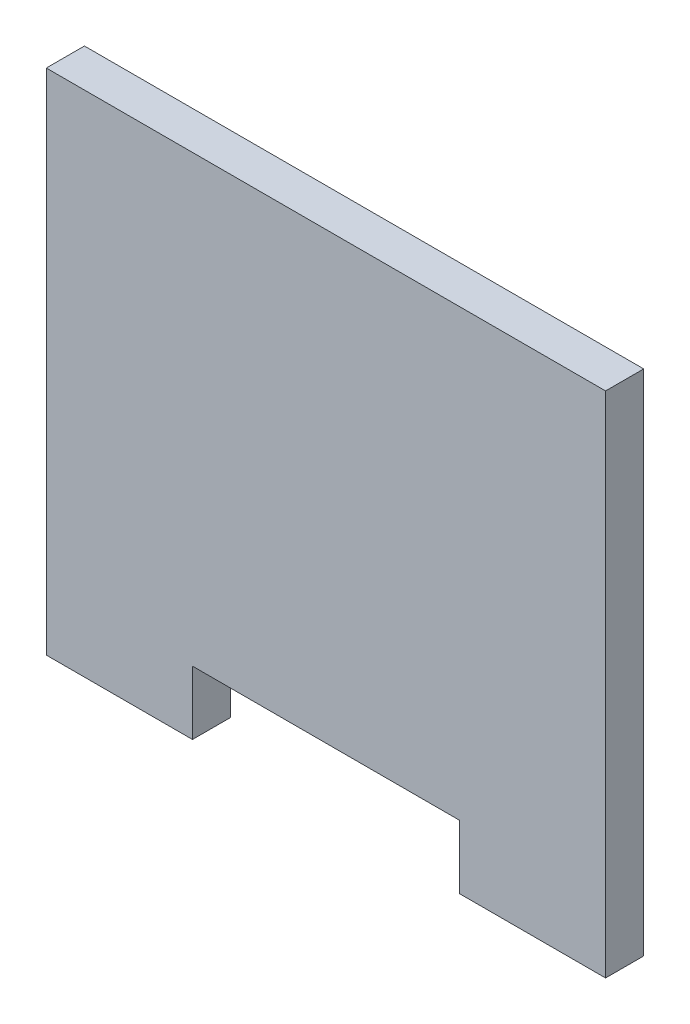
ISO-10303-21;
HEADER;
FILE_DESCRIPTION(('STEP AP214'),'2;1');
FILE_NAME('part.step','',(''),(''),'','','');
FILE_SCHEMA(('AUTOMOTIVE_DESIGN { 1 0 10303 214 1 1 1 1 }'));
ENDSEC;
DATA;
#1=APPLICATION_CONTEXT('core data for automotive mechanical design processes');
#2=APPLICATION_PROTOCOL_DEFINITION('international standard','automotive_design',2000,#1);
#3=PRODUCT_CONTEXT('',#1,'mechanical');
#4=PRODUCT('Part','Part','',(#3));
#5=PRODUCT_RELATED_PRODUCT_CATEGORY('part','',(#4));
#6=PRODUCT_DEFINITION_FORMATION('','',#4);
#7=PRODUCT_DEFINITION_CONTEXT('part definition',#1,'design');
#8=PRODUCT_DEFINITION('design','',#6,#7);
#9=PRODUCT_DEFINITION_SHAPE('','',#8);
#10=(LENGTH_UNIT() NAMED_UNIT(*) SI_UNIT(.MILLI.,.METRE.));
#11=(NAMED_UNIT(*) PLANE_ANGLE_UNIT() SI_UNIT($,.RADIAN.));
#12=(NAMED_UNIT(*) SI_UNIT($,.STERADIAN.) SOLID_ANGLE_UNIT());
#13=UNCERTAINTY_MEASURE_WITH_UNIT(LENGTH_MEASURE(1.E-05),#10,'distance_accuracy_value','');
#14=(GEOMETRIC_REPRESENTATION_CONTEXT(3) GLOBAL_UNCERTAINTY_ASSIGNED_CONTEXT((#13)) GLOBAL_UNIT_ASSIGNED_CONTEXT((#10,
#11,#12)) REPRESENTATION_CONTEXT('',''));
#15=CARTESIAN_POINT('',(0.,0.,0.));
#16=DIRECTION('',(0.,0.,1.));
#17=DIRECTION('',(1.,0.,0.));
#18=AXIS2_PLACEMENT_3D('',#15,#16,#17);
#19=CARTESIAN_POINT('',(-22.6948207171315,30.5659463337186,3.));
#20=DIRECTION('',(1.,0.,0.));
#21=DIRECTION('',(0.,1.,0.));
#22=AXIS2_PLACEMENT_3D('',#19,#20,#21);
#23=PLANE('',#22);
#24=DIRECTION('',(0.,-1.,0.));
#25=VECTOR('',#24,1.);
#26=CARTESIAN_POINT('',(-22.6948207171315,30.5659463337186,0.));
#27=LINE('',#26,#25);
#28=CARTESIAN_POINT('',(-22.6948207171315,30.5659463337186,0.));
#29=VERTEX_POINT('',#28);
#30=CARTESIAN_POINT('',(-22.6948207171315,-9.4340536662814,0.));
#31=VERTEX_POINT('',#30);
#32=EDGE_CURVE('E193',#29,#31,#27,.T.);
#33=ORIENTED_EDGE('',*,*,#32,.T.);
#34=DIRECTION('',(0.,0.,-1.));
#35=VECTOR('',#34,1.);
#36=CARTESIAN_POINT('',(-22.6948207171315,-9.4340536662814,3.));
#37=LINE('',#36,#35);
#38=CARTESIAN_POINT('',(-22.6948207171315,-9.4340536662814,3.));
#39=VERTEX_POINT('',#38);
#40=EDGE_CURVE('E12',#39,#31,#37,.T.);
#41=ORIENTED_EDGE('',*,*,#40,.F.);
#42=DIRECTION('',(0.,-1.,0.));
#43=VECTOR('',#42,1.);
#44=CARTESIAN_POINT('',(-22.6948207171315,30.5659463337186,3.));
#45=LINE('',#44,#43);
#46=CARTESIAN_POINT('',(-22.6948207171315,30.5659463337186,3.));
#47=VERTEX_POINT('',#46);
#48=EDGE_CURVE('E158',#47,#39,#45,.T.);
#49=ORIENTED_EDGE('',*,*,#48,.F.);
#50=DIRECTION('',(0.,0.,-1.));
#51=VECTOR('',#50,1.);
#52=CARTESIAN_POINT('',(-22.6948207171315,30.5659463337186,3.));
#53=LINE('',#52,#51);
#54=EDGE_CURVE('E133',#47,#29,#53,.T.);
#55=ORIENTED_EDGE('',*,*,#54,.T.);
#56=EDGE_LOOP('',(#33,#41,#49,#55));
#57=FACE_BOUND('',#56,.T.);
#58=ADVANCED_FACE('F38',(#57),#23,.F.);
#59=CARTESIAN_POINT('',(-22.6948207171315,-9.4340536662814,3.));
#60=DIRECTION('',(0.,1.,0.));
#61=DIRECTION('',(-1.,0.,0.));
#62=AXIS2_PLACEMENT_3D('',#59,#60,#61);
#63=PLANE('',#62);
#64=DIRECTION('',(1.,0.,0.));
#65=VECTOR('',#64,1.);
#66=CARTESIAN_POINT('',(-22.6948207171315,-9.4340536662814,0.));
#67=LINE('',#66,#65);
#68=CARTESIAN_POINT('',(-11.1948207171315,-9.4340536662814,0.));
#69=VERTEX_POINT('',#68);
#70=EDGE_CURVE('E187',#31,#69,#67,.T.);
#71=ORIENTED_EDGE('',*,*,#70,.T.);
#72=DIRECTION('',(0.,0.,-1.));
#73=VECTOR('',#72,1.);
#74=CARTESIAN_POINT('',(-11.1948207171315,-9.4340536662814,3.));
#75=LINE('',#74,#73);
#76=CARTESIAN_POINT('',(-11.1948207171315,-9.4340536662814,3.));
#77=VERTEX_POINT('',#76);
#78=EDGE_CURVE('E46',#77,#69,#75,.T.);
#79=ORIENTED_EDGE('',*,*,#78,.F.);
#80=DIRECTION('',(1.,0.,0.));
#81=VECTOR('',#80,1.);
#82=CARTESIAN_POINT('',(-22.6948207171315,-9.4340536662814,3.));
#83=LINE('',#82,#81);
#84=EDGE_CURVE('E97',#39,#77,#83,.T.);
#85=ORIENTED_EDGE('',*,*,#84,.F.);
#86=ORIENTED_EDGE('',*,*,#40,.T.);
#87=EDGE_LOOP('',(#71,#79,#85,#86));
#88=FACE_BOUND('',#87,.T.);
#89=ADVANCED_FACE('F212',(#88),#63,.F.);
#90=CARTESIAN_POINT('',(-11.1948207171315,-4.43405366628141,3.));
#91=DIRECTION('',(-1.,0.,0.));
#92=DIRECTION('',(0.,0.,1.));
#93=AXIS2_PLACEMENT_3D('',#90,#91,#92);
#94=PLANE('',#93);
#95=DIRECTION('',(0.,1.,0.));
#96=VECTOR('',#95,1.);
#97=CARTESIAN_POINT('',(-11.1948207171315,-4.43405366628141,0.));
#98=LINE('',#97,#96);
#99=CARTESIAN_POINT('',(-11.1948207171315,-4.43405366628141,0.));
#100=VERTEX_POINT('',#99);
#101=EDGE_CURVE('E182',#69,#100,#98,.T.);
#102=ORIENTED_EDGE('',*,*,#101,.T.);
#103=DIRECTION('',(0.,0.,-1.));
#104=VECTOR('',#103,1.);
#105=CARTESIAN_POINT('',(-11.1948207171315,-4.43405366628141,3.));
#106=LINE('',#105,#104);
#107=CARTESIAN_POINT('',(-11.1948207171315,-4.43405366628141,3.));
#108=VERTEX_POINT('',#107);
#109=EDGE_CURVE('E174',#108,#100,#106,.T.);
#110=ORIENTED_EDGE('',*,*,#109,.F.);
#111=DIRECTION('',(0.,1.,0.));
#112=VECTOR('',#111,1.);
#113=CARTESIAN_POINT('',(-11.1948207171315,-4.43405366628141,3.));
#114=LINE('',#113,#112);
#115=EDGE_CURVE('E150',#77,#108,#114,.T.);
#116=ORIENTED_EDGE('',*,*,#115,.F.);
#117=ORIENTED_EDGE('',*,*,#78,.T.);
#118=EDGE_LOOP('',(#102,#110,#116,#117));
#119=FACE_BOUND('',#118,.T.);
#120=ADVANCED_FACE('F180',(#119),#94,.F.);
#121=CARTESIAN_POINT('',(-11.1948207171315,-4.43405366628141,3.));
#122=DIRECTION('',(0.,1.,0.));
#123=DIRECTION('',(-1.,0.,0.));
#124=AXIS2_PLACEMENT_3D('',#121,#122,#123);
#125=PLANE('',#124);
#126=DIRECTION('',(1.,0.,0.));
#127=VECTOR('',#126,1.);
#128=CARTESIAN_POINT('',(-11.1948207171315,-4.43405366628141,0.));
#129=LINE('',#128,#127);
#130=CARTESIAN_POINT('',(9.8051792828685,-4.4340536662814,0.));
#131=VERTEX_POINT('',#130);
#132=EDGE_CURVE('E189',#100,#131,#129,.T.);
#133=ORIENTED_EDGE('',*,*,#132,.T.);
#134=DIRECTION('',(0.,0.,-1.));
#135=VECTOR('',#134,1.);
#136=CARTESIAN_POINT('',(9.8051792828685,-4.4340536662814,3.));
#137=LINE('',#136,#135);
#138=CARTESIAN_POINT('',(9.8051792828685,-4.4340536662814,3.));
#139=VERTEX_POINT('',#138);
#140=EDGE_CURVE('E171',#139,#131,#137,.T.);
#141=ORIENTED_EDGE('',*,*,#140,.F.);
#142=DIRECTION('',(1.,0.,0.));
#143=VECTOR('',#142,1.);
#144=CARTESIAN_POINT('',(-11.1948207171315,-4.43405366628141,3.));
#145=LINE('',#144,#143);
#146=EDGE_CURVE('E146',#108,#139,#145,.T.);
#147=ORIENTED_EDGE('',*,*,#146,.F.);
#148=ORIENTED_EDGE('',*,*,#109,.T.);
#149=EDGE_LOOP('',(#133,#141,#147,#148));
#150=FACE_BOUND('',#149,.T.);
#151=ADVANCED_FACE('F219',(#150),#125,.F.);
#152=CARTESIAN_POINT('',(9.8051792828685,-4.4340536662814,3.));
#153=DIRECTION('',(1.,0.,0.));
#154=DIRECTION('',(0.,0.,-1.));
#155=AXIS2_PLACEMENT_3D('',#152,#153,#154);
#156=PLANE('',#155);
#157=DIRECTION('',(0.,-1.,0.));
#158=VECTOR('',#157,1.);
#159=CARTESIAN_POINT('',(9.8051792828685,-4.4340536662814,0.));
#160=LINE('',#159,#158);
#161=CARTESIAN_POINT('',(9.8051792828685,-9.4340536662814,0.));
#162=VERTEX_POINT('',#161);
#163=EDGE_CURVE('E191',#131,#162,#160,.T.);
#164=ORIENTED_EDGE('',*,*,#163,.T.);
#165=DIRECTION('',(0.,0.,-1.));
#166=VECTOR('',#165,1.);
#167=CARTESIAN_POINT('',(9.8051792828685,-9.4340536662814,3.));
#168=LINE('',#167,#166);
#169=CARTESIAN_POINT('',(9.8051792828685,-9.4340536662814,3.));
#170=VERTEX_POINT('',#169);
#171=EDGE_CURVE('E126',#170,#162,#168,.T.);
#172=ORIENTED_EDGE('',*,*,#171,.F.);
#173=DIRECTION('',(0.,-1.,0.));
#174=VECTOR('',#173,1.);
#175=CARTESIAN_POINT('',(9.8051792828685,-4.4340536662814,3.));
#176=LINE('',#175,#174);
#177=EDGE_CURVE('E116',#139,#170,#176,.T.);
#178=ORIENTED_EDGE('',*,*,#177,.F.);
#179=ORIENTED_EDGE('',*,*,#140,.T.);
#180=EDGE_LOOP('',(#164,#172,#178,#179));
#181=FACE_BOUND('',#180,.T.);
#182=ADVANCED_FACE('F197',(#181),#156,.F.);
#183=CARTESIAN_POINT('',(9.8051792828685,-9.4340536662814,3.));
#184=DIRECTION('',(0.,1.,0.));
#185=DIRECTION('',(0.,0.,1.));
#186=AXIS2_PLACEMENT_3D('',#183,#184,#185);
#187=PLANE('',#186);
#188=DIRECTION('',(1.,0.,0.));
#189=VECTOR('',#188,1.);
#190=CARTESIAN_POINT('',(9.8051792828685,-9.4340536662814,0.));
#191=LINE('',#190,#189);
#192=CARTESIAN_POINT('',(21.3051792828685,-9.4340536662814,0.));
#193=VERTEX_POINT('',#192);
#194=EDGE_CURVE('E125',#162,#193,#191,.T.);
#195=ORIENTED_EDGE('',*,*,#194,.T.);
#196=DIRECTION('',(0.,0.,-1.));
#197=VECTOR('',#196,1.);
#198=CARTESIAN_POINT('',(21.3051792828685,-9.4340536662814,3.));
#199=LINE('',#198,#197);
#200=CARTESIAN_POINT('',(21.3051792828685,-9.4340536662814,3.));
#201=VERTEX_POINT('',#200);
#202=EDGE_CURVE('E122',#201,#193,#199,.T.);
#203=ORIENTED_EDGE('',*,*,#202,.F.);
#204=DIRECTION('',(1.,0.,0.));
#205=VECTOR('',#204,1.);
#206=CARTESIAN_POINT('',(9.8051792828685,-9.4340536662814,3.));
#207=LINE('',#206,#205);
#208=EDGE_CURVE('E110',#170,#201,#207,.T.);
#209=ORIENTED_EDGE('',*,*,#208,.F.);
#210=ORIENTED_EDGE('',*,*,#171,.T.);
#211=EDGE_LOOP('',(#195,#203,#209,#210));
#212=FACE_BOUND('',#211,.T.);
#213=ADVANCED_FACE('F123',(#212),#187,.F.);
#214=CARTESIAN_POINT('',(21.3051792828685,30.5659463337186,3.));
#215=DIRECTION('',(-1.,0.,0.));
#216=DIRECTION('',(0.,-1.,0.));
#217=AXIS2_PLACEMENT_3D('',#214,#215,#216);
#218=PLANE('',#217);
#219=DIRECTION('',(0.,1.,0.));
#220=VECTOR('',#219,1.);
#221=CARTESIAN_POINT('',(21.3051792828685,30.5659463337186,0.));
#222=LINE('',#221,#220);
#223=CARTESIAN_POINT('',(21.3051792828685,30.5659463337186,0.));
#224=VERTEX_POINT('',#223);
#225=EDGE_CURVE('E83',#193,#224,#222,.T.);
#226=ORIENTED_EDGE('',*,*,#225,.T.);
#227=DIRECTION('',(0.,0.,-1.));
#228=VECTOR('',#227,1.);
#229=CARTESIAN_POINT('',(21.3051792828685,30.5659463337186,3.));
#230=LINE('',#229,#228);
#231=CARTESIAN_POINT('',(21.3051792828685,30.5659463337186,3.));
#232=VERTEX_POINT('',#231);
#233=EDGE_CURVE('E127',#232,#224,#230,.T.);
#234=ORIENTED_EDGE('',*,*,#233,.F.);
#235=DIRECTION('',(0.,1.,0.));
#236=VECTOR('',#235,1.);
#237=CARTESIAN_POINT('',(21.3051792828685,30.5659463337186,3.));
#238=LINE('',#237,#236);
#239=EDGE_CURVE('E114',#201,#232,#238,.T.);
#240=ORIENTED_EDGE('',*,*,#239,.F.);
#241=ORIENTED_EDGE('',*,*,#202,.T.);
#242=EDGE_LOOP('',(#226,#234,#240,#241));
#243=FACE_BOUND('',#242,.T.);
#244=ADVANCED_FACE('F129',(#243),#218,.F.);
#245=CARTESIAN_POINT('',(-22.6948207171315,30.5659463337186,3.));
#246=DIRECTION('',(0.,-1.,0.));
#247=DIRECTION('',(0.,0.,-1.));
#248=AXIS2_PLACEMENT_3D('',#245,#246,#247);
#249=PLANE('',#248);
#250=DIRECTION('',(-1.,0.,0.));
#251=VECTOR('',#250,1.);
#252=CARTESIAN_POINT('',(-22.6948207171315,30.5659463337186,0.));
#253=LINE('',#252,#251);
#254=EDGE_CURVE('E89',#224,#29,#253,.T.);
#255=ORIENTED_EDGE('',*,*,#254,.T.);
#256=ORIENTED_EDGE('',*,*,#54,.F.);
#257=DIRECTION('',(-1.,0.,0.));
#258=VECTOR('',#257,1.);
#259=CARTESIAN_POINT('',(-22.6948207171315,30.5659463337186,3.));
#260=LINE('',#259,#258);
#261=EDGE_CURVE('E54',#232,#47,#260,.T.);
#262=ORIENTED_EDGE('',*,*,#261,.F.);
#263=ORIENTED_EDGE('',*,*,#233,.T.);
#264=EDGE_LOOP('',(#255,#256,#262,#263));
#265=FACE_BOUND('',#264,.T.);
#266=ADVANCED_FACE('F201',(#265),#249,.F.);
#267=CARTESIAN_POINT('',(0.,0.,3.));
#268=DIRECTION('',(0.,0.,1.));
#269=DIRECTION('',(1.,0.,0.));
#270=AXIS2_PLACEMENT_3D('',#267,#268,#269);
#271=PLANE('',#270);
#272=ORIENTED_EDGE('',*,*,#48,.T.);
#273=ORIENTED_EDGE('',*,*,#84,.T.);
#274=ORIENTED_EDGE('',*,*,#115,.T.);
#275=ORIENTED_EDGE('',*,*,#146,.T.);
#276=ORIENTED_EDGE('',*,*,#177,.T.);
#277=ORIENTED_EDGE('',*,*,#208,.T.);
#278=ORIENTED_EDGE('',*,*,#239,.T.);
#279=ORIENTED_EDGE('',*,*,#261,.T.);
#280=EDGE_LOOP('',(#272,#273,#274,#275,#276,#277,#278,#279));
#281=FACE_BOUND('',#280,.T.);
#282=ADVANCED_FACE('F112',(#281),#271,.T.);
#283=CARTESIAN_POINT('',(0.,0.,0.));
#284=DIRECTION('',(0.,0.,1.));
#285=DIRECTION('',(1.,0.,0.));
#286=AXIS2_PLACEMENT_3D('',#283,#284,#285);
#287=PLANE('',#286);
#288=ORIENTED_EDGE('',*,*,#32,.F.);
#289=ORIENTED_EDGE('',*,*,#254,.F.);
#290=ORIENTED_EDGE('',*,*,#225,.F.);
#291=ORIENTED_EDGE('',*,*,#194,.F.);
#292=ORIENTED_EDGE('',*,*,#163,.F.);
#293=ORIENTED_EDGE('',*,*,#132,.F.);
#294=ORIENTED_EDGE('',*,*,#101,.F.);
#295=ORIENTED_EDGE('',*,*,#70,.F.);
#296=EDGE_LOOP('',(#288,#289,#290,#291,#292,#293,#294,#295));
#297=FACE_BOUND('',#296,.T.);
#298=ADVANCED_FACE('F186',(#297),#287,.F.);
#299=CLOSED_SHELL('',(#58,#89,#120,#151,#182,#213,#244,#266,#282,#298));
#300=MANIFOLD_SOLID_BREP('B2',#299);
#301=ADVANCED_BREP_SHAPE_REPRESENTATION('',(#18,#300),#14);
#302=SHAPE_DEFINITION_REPRESENTATION(#9,#301);
ENDSEC;
END-ISO-10303-21;
